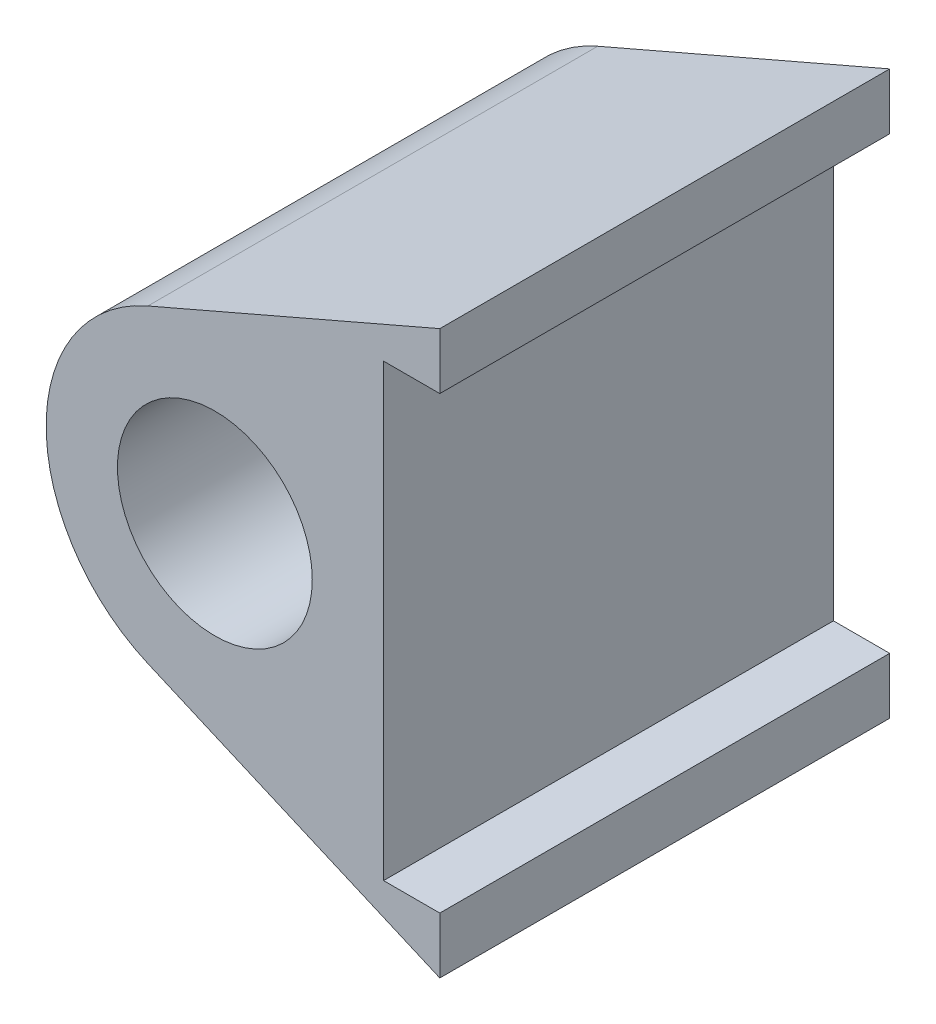
ISO-10303-21;
HEADER;
FILE_DESCRIPTION(('STEP AP214'),'2;1');
FILE_NAME('part.step','',(''),(''),'','','');
FILE_SCHEMA(('AUTOMOTIVE_DESIGN { 1 0 10303 214 1 1 1 1 }'));
ENDSEC;
DATA;
#1=APPLICATION_CONTEXT('core data for automotive mechanical design processes');
#2=APPLICATION_PROTOCOL_DEFINITION('international standard','automotive_design',2000,#1);
#3=PRODUCT_CONTEXT('',#1,'mechanical');
#4=PRODUCT('Part','Part','',(#3));
#5=PRODUCT_RELATED_PRODUCT_CATEGORY('part','',(#4));
#6=PRODUCT_DEFINITION_FORMATION('','',#4);
#7=PRODUCT_DEFINITION_CONTEXT('part definition',#1,'design');
#8=PRODUCT_DEFINITION('design','',#6,#7);
#9=PRODUCT_DEFINITION_SHAPE('','',#8);
#10=(LENGTH_UNIT() NAMED_UNIT(*) SI_UNIT(.MILLI.,.METRE.));
#11=(NAMED_UNIT(*) PLANE_ANGLE_UNIT() SI_UNIT($,.RADIAN.));
#12=(NAMED_UNIT(*) SI_UNIT($,.STERADIAN.) SOLID_ANGLE_UNIT());
#13=UNCERTAINTY_MEASURE_WITH_UNIT(LENGTH_MEASURE(1.E-05),#10,'distance_accuracy_value','');
#14=(GEOMETRIC_REPRESENTATION_CONTEXT(3) GLOBAL_UNCERTAINTY_ASSIGNED_CONTEXT((#13)) GLOBAL_UNIT_ASSIGNED_CONTEXT((#10,
#11,#12)) REPRESENTATION_CONTEXT('',''));
#15=CARTESIAN_POINT('',(0.,0.,0.));
#16=DIRECTION('',(0.,0.,1.));
#17=DIRECTION('',(1.,0.,0.));
#18=AXIS2_PLACEMENT_3D('',#15,#16,#17);
#19=CARTESIAN_POINT('',(0.,0.,50.8));
#20=DIRECTION('',(0.,0.,1.));
#21=DIRECTION('',(1.,0.,0.));
#22=AXIS2_PLACEMENT_3D('',#19,#20,#21);
#23=PLANE('',#22);
#24=DIRECTION('',(-0.917741877999257,-0.397177347499071,0.));
#25=VECTOR('',#24,1.);
#26=CARTESIAN_POINT('',(25.4,31.75,50.8));
#27=LINE('',#26,#25);
#28=CARTESIAN_POINT('',(25.4,31.75,50.8));
#29=VERTEX_POINT('',#28);
#30=CARTESIAN_POINT('',(-7.5662284698573,17.4829827758858,50.8));
#31=VERTEX_POINT('',#30);
#32=EDGE_CURVE('E164',#29,#31,#27,.T.);
#33=ORIENTED_EDGE('',*,*,#32,.T.);
#34=CARTESIAN_POINT('',(0.,0.,50.8));
#35=DIRECTION('',(0.,0.,1.));
#36=DIRECTION('',(1.,0.,0.));
#37=AXIS2_PLACEMENT_3D('',#34,#35,#36);
#38=CIRCLE('',#37,19.05);
#39=CARTESIAN_POINT('',(-7.5662284698573,-17.4829827758858,50.8));
#40=VERTEX_POINT('',#39);
#41=EDGE_CURVE('E100',#31,#40,#38,.T.);
#42=ORIENTED_EDGE('',*,*,#41,.T.);
#43=DIRECTION('',(0.917741877999256,-0.397177347499071,0.));
#44=VECTOR('',#43,1.);
#45=CARTESIAN_POINT('',(25.4,-31.75,50.8));
#46=LINE('',#45,#44);
#47=CARTESIAN_POINT('',(25.4,-31.75,50.8));
#48=VERTEX_POINT('',#47);
#49=EDGE_CURVE('E185',#40,#48,#46,.T.);
#50=ORIENTED_EDGE('',*,*,#49,.T.);
#51=DIRECTION('',(0.,1.,0.));
#52=VECTOR('',#51,1.);
#53=CARTESIAN_POINT('',(25.4,-25.4,50.8));
#54=LINE('',#53,#52);
#55=CARTESIAN_POINT('',(25.4,-25.4,50.8));
#56=VERTEX_POINT('',#55);
#57=EDGE_CURVE('E199',#48,#56,#54,.T.);
#58=ORIENTED_EDGE('',*,*,#57,.T.);
#59=DIRECTION('',(-1.,0.,0.));
#60=VECTOR('',#59,1.);
#61=CARTESIAN_POINT('',(19.05,-25.4,50.8));
#62=LINE('',#61,#60);
#63=CARTESIAN_POINT('',(19.05,-25.4,50.8));
#64=VERTEX_POINT('',#63);
#65=EDGE_CURVE('E119',#56,#64,#62,.T.);
#66=ORIENTED_EDGE('',*,*,#65,.T.);
#67=DIRECTION('',(0.,1.,0.));
#68=VECTOR('',#67,1.);
#69=CARTESIAN_POINT('',(19.05,-25.4,50.8));
#70=LINE('',#69,#68);
#71=CARTESIAN_POINT('',(19.05,25.4,50.8));
#72=VERTEX_POINT('',#71);
#73=EDGE_CURVE('E113',#64,#72,#70,.T.);
#74=ORIENTED_EDGE('',*,*,#73,.T.);
#75=DIRECTION('',(1.,0.,0.));
#76=VECTOR('',#75,1.);
#77=CARTESIAN_POINT('',(19.05,25.4,50.8));
#78=LINE('',#77,#76);
#79=CARTESIAN_POINT('',(25.4,25.4,50.8));
#80=VERTEX_POINT('',#79);
#81=EDGE_CURVE('E117',#72,#80,#78,.T.);
#82=ORIENTED_EDGE('',*,*,#81,.T.);
#83=DIRECTION('',(0.,1.,0.));
#84=VECTOR('',#83,1.);
#85=CARTESIAN_POINT('',(25.4,25.4,50.8));
#86=LINE('',#85,#84);
#87=EDGE_CURVE('E57',#80,#29,#86,.T.);
#88=ORIENTED_EDGE('',*,*,#87,.T.);
#89=EDGE_LOOP('',(#33,#42,#50,#58,#66,#74,#82,#88));
#90=FACE_BOUND('',#89,.T.);
#91=CARTESIAN_POINT('',(0.,0.,50.8));
#92=DIRECTION('',(0.,0.,1.));
#93=DIRECTION('',(1.,0.,0.));
#94=AXIS2_PLACEMENT_3D('',#91,#92,#93);
#95=CIRCLE('',#94,10.99947);
#96=CARTESIAN_POINT('',(10.99947,0.,50.8));
#97=VERTEX_POINT('',#96);
#98=EDGE_CURVE('E146',#97,#97,#95,.T.);
#99=ORIENTED_EDGE('',*,*,#98,.F.);
#100=EDGE_LOOP('',(#99));
#101=FACE_BOUND('',#100,.T.);
#102=ADVANCED_FACE('F39',(#90,#101),#23,.T.);
#103=CARTESIAN_POINT('',(0.,0.,0.));
#104=DIRECTION('',(0.,0.,1.));
#105=DIRECTION('',(1.,0.,0.));
#106=AXIS2_PLACEMENT_3D('',#103,#104,#105);
#107=PLANE('',#106);
#108=DIRECTION('',(-0.917741877999257,-0.397177347499071,0.));
#109=VECTOR('',#108,1.);
#110=CARTESIAN_POINT('',(25.4,31.75,0.));
#111=LINE('',#110,#109);
#112=CARTESIAN_POINT('',(25.4,31.75,0.));
#113=VERTEX_POINT('',#112);
#114=CARTESIAN_POINT('',(-7.5662284698573,17.4829827758858,0.));
#115=VERTEX_POINT('',#114);
#116=EDGE_CURVE('E141',#113,#115,#111,.T.);
#117=ORIENTED_EDGE('',*,*,#116,.F.);
#118=DIRECTION('',(0.,1.,0.));
#119=VECTOR('',#118,1.);
#120=CARTESIAN_POINT('',(25.4,25.4,0.));
#121=LINE('',#120,#119);
#122=CARTESIAN_POINT('',(25.4,25.4,0.));
#123=VERTEX_POINT('',#122);
#124=EDGE_CURVE('E92',#123,#113,#121,.T.);
#125=ORIENTED_EDGE('',*,*,#124,.F.);
#126=DIRECTION('',(1.,0.,0.));
#127=VECTOR('',#126,1.);
#128=CARTESIAN_POINT('',(19.05,25.4,0.));
#129=LINE('',#128,#127);
#130=CARTESIAN_POINT('',(19.05,25.4,0.));
#131=VERTEX_POINT('',#130);
#132=EDGE_CURVE('E86',#131,#123,#129,.T.);
#133=ORIENTED_EDGE('',*,*,#132,.F.);
#134=DIRECTION('',(0.,1.,0.));
#135=VECTOR('',#134,1.);
#136=CARTESIAN_POINT('',(19.05,-25.4,0.));
#137=LINE('',#136,#135);
#138=CARTESIAN_POINT('',(19.05,-25.4,0.));
#139=VERTEX_POINT('',#138);
#140=EDGE_CURVE('E128',#139,#131,#137,.T.);
#141=ORIENTED_EDGE('',*,*,#140,.F.);
#142=DIRECTION('',(-1.,0.,0.));
#143=VECTOR('',#142,1.);
#144=CARTESIAN_POINT('',(19.05,-25.4,0.));
#145=LINE('',#144,#143);
#146=CARTESIAN_POINT('',(25.4,-25.4,0.));
#147=VERTEX_POINT('',#146);
#148=EDGE_CURVE('E155',#147,#139,#145,.T.);
#149=ORIENTED_EDGE('',*,*,#148,.F.);
#150=DIRECTION('',(0.,1.,0.));
#151=VECTOR('',#150,1.);
#152=CARTESIAN_POINT('',(25.4,-25.4,0.));
#153=LINE('',#152,#151);
#154=CARTESIAN_POINT('',(25.4,-31.75,0.));
#155=VERTEX_POINT('',#154);
#156=EDGE_CURVE('E152',#155,#147,#153,.T.);
#157=ORIENTED_EDGE('',*,*,#156,.F.);
#158=DIRECTION('',(0.917741877999256,-0.397177347499071,0.));
#159=VECTOR('',#158,1.);
#160=CARTESIAN_POINT('',(25.4,-31.75,0.));
#161=LINE('',#160,#159);
#162=CARTESIAN_POINT('',(-7.5662284698573,-17.4829827758858,0.));
#163=VERTEX_POINT('',#162);
#164=EDGE_CURVE('E149',#163,#155,#161,.T.);
#165=ORIENTED_EDGE('',*,*,#164,.F.);
#166=CARTESIAN_POINT('',(0.,0.,0.));
#167=DIRECTION('',(0.,0.,1.));
#168=DIRECTION('',(1.,0.,0.));
#169=AXIS2_PLACEMENT_3D('',#166,#167,#168);
#170=CIRCLE('',#169,19.05);
#171=EDGE_CURVE('E145',#115,#163,#170,.T.);
#172=ORIENTED_EDGE('',*,*,#171,.F.);
#173=EDGE_LOOP('',(#117,#125,#133,#141,#149,#157,#165,#172));
#174=FACE_BOUND('',#173,.T.);
#175=CARTESIAN_POINT('',(0.,0.,0.));
#176=DIRECTION('',(0.,0.,1.));
#177=DIRECTION('',(1.,0.,0.));
#178=AXIS2_PLACEMENT_3D('',#175,#176,#177);
#179=CIRCLE('',#178,10.99947);
#180=CARTESIAN_POINT('',(10.99947,0.,0.));
#181=VERTEX_POINT('',#180);
#182=EDGE_CURVE('E209',#181,#181,#179,.T.);
#183=ORIENTED_EDGE('',*,*,#182,.T.);
#184=EDGE_LOOP('',(#183));
#185=FACE_BOUND('',#184,.T.);
#186=ADVANCED_FACE('F189',(#174,#185),#107,.F.);
#187=CARTESIAN_POINT('',(25.4,31.75,50.8));
#188=DIRECTION('',(0.397177347499071,-0.917741877999257,0.));
#189=DIRECTION('',(0.917741877999257,0.397177347499071,0.));
#190=AXIS2_PLACEMENT_3D('',#187,#188,#189);
#191=PLANE('',#190);
#192=ORIENTED_EDGE('',*,*,#116,.T.);
#193=DIRECTION('',(0.,0.,-1.));
#194=VECTOR('',#193,1.);
#195=CARTESIAN_POINT('',(-7.5662284698573,17.4829827758858,50.8));
#196=LINE('',#195,#194);
#197=EDGE_CURVE('E11',#31,#115,#196,.T.);
#198=ORIENTED_EDGE('',*,*,#197,.F.);
#199=ORIENTED_EDGE('',*,*,#32,.F.);
#200=DIRECTION('',(0.,0.,-1.));
#201=VECTOR('',#200,1.);
#202=CARTESIAN_POINT('',(25.4,31.75,50.8));
#203=LINE('',#202,#201);
#204=EDGE_CURVE('E137',#29,#113,#203,.T.);
#205=ORIENTED_EDGE('',*,*,#204,.T.);
#206=EDGE_LOOP('',(#192,#198,#199,#205));
#207=FACE_BOUND('',#206,.T.);
#208=ADVANCED_FACE('F41',(#207),#191,.F.);
#209=CARTESIAN_POINT('',(0.,0.,50.8));
#210=DIRECTION('',(0.,0.,-1.));
#211=DIRECTION('',(-1.,0.,0.));
#212=AXIS2_PLACEMENT_3D('',#209,#210,#211);
#213=CYLINDRICAL_SURFACE('',#212,19.05);
#214=ORIENTED_EDGE('',*,*,#171,.T.);
#215=DIRECTION('',(0.,0.,-1.));
#216=VECTOR('',#215,1.);
#217=CARTESIAN_POINT('',(-7.5662284698573,-17.4829827758858,50.8));
#218=LINE('',#217,#216);
#219=EDGE_CURVE('E49',#40,#163,#218,.T.);
#220=ORIENTED_EDGE('',*,*,#219,.F.);
#221=ORIENTED_EDGE('',*,*,#41,.F.);
#222=ORIENTED_EDGE('',*,*,#197,.T.);
#223=EDGE_LOOP('',(#214,#220,#221,#222));
#224=FACE_BOUND('',#223,.T.);
#225=ADVANCED_FACE('F239',(#224),#213,.T.);
#226=CARTESIAN_POINT('',(25.4,-31.75,50.8));
#227=DIRECTION('',(0.397177347499071,0.917741877999257,0.));
#228=DIRECTION('',(-0.917741877999257,0.397177347499071,0.));
#229=AXIS2_PLACEMENT_3D('',#226,#227,#228);
#230=PLANE('',#229);
#231=ORIENTED_EDGE('',*,*,#164,.T.);
#232=DIRECTION('',(0.,0.,-1.));
#233=VECTOR('',#232,1.);
#234=CARTESIAN_POINT('',(25.4,-31.75,50.8));
#235=LINE('',#234,#233);
#236=EDGE_CURVE('E175',#48,#155,#235,.T.);
#237=ORIENTED_EDGE('',*,*,#236,.F.);
#238=ORIENTED_EDGE('',*,*,#49,.F.);
#239=ORIENTED_EDGE('',*,*,#219,.T.);
#240=EDGE_LOOP('',(#231,#237,#238,#239));
#241=FACE_BOUND('',#240,.T.);
#242=ADVANCED_FACE('F183',(#241),#230,.F.);
#243=CARTESIAN_POINT('',(25.4,-25.4,50.8));
#244=DIRECTION('',(-1.,0.,0.));
#245=DIRECTION('',(0.,-1.,0.));
#246=AXIS2_PLACEMENT_3D('',#243,#244,#245);
#247=PLANE('',#246);
#248=ORIENTED_EDGE('',*,*,#156,.T.);
#249=DIRECTION('',(0.,0.,-1.));
#250=VECTOR('',#249,1.);
#251=CARTESIAN_POINT('',(25.4,-25.4,50.8));
#252=LINE('',#251,#250);
#253=EDGE_CURVE('E171',#56,#147,#252,.T.);
#254=ORIENTED_EDGE('',*,*,#253,.F.);
#255=ORIENTED_EDGE('',*,*,#57,.F.);
#256=ORIENTED_EDGE('',*,*,#236,.T.);
#257=EDGE_LOOP('',(#248,#254,#255,#256));
#258=FACE_BOUND('',#257,.T.);
#259=ADVANCED_FACE('F194',(#258),#247,.F.);
#260=CARTESIAN_POINT('',(19.05,-25.4,50.8));
#261=DIRECTION('',(0.,-1.,0.));
#262=DIRECTION('',(0.,0.,-1.));
#263=AXIS2_PLACEMENT_3D('',#260,#261,#262);
#264=PLANE('',#263);
#265=ORIENTED_EDGE('',*,*,#148,.T.);
#266=DIRECTION('',(0.,0.,-1.));
#267=VECTOR('',#266,1.);
#268=CARTESIAN_POINT('',(19.05,-25.4,50.8));
#269=LINE('',#268,#267);
#270=EDGE_CURVE('E130',#64,#139,#269,.T.);
#271=ORIENTED_EDGE('',*,*,#270,.F.);
#272=ORIENTED_EDGE('',*,*,#65,.F.);
#273=ORIENTED_EDGE('',*,*,#253,.T.);
#274=EDGE_LOOP('',(#265,#271,#272,#273));
#275=FACE_BOUND('',#274,.T.);
#276=ADVANCED_FACE('F197',(#275),#264,.F.);
#277=CARTESIAN_POINT('',(19.05,-25.4,50.8));
#278=DIRECTION('',(-1.,0.,0.));
#279=DIRECTION('',(0.,-1.,0.));
#280=AXIS2_PLACEMENT_3D('',#277,#278,#279);
#281=PLANE('',#280);
#282=ORIENTED_EDGE('',*,*,#140,.T.);
#283=DIRECTION('',(0.,0.,-1.));
#284=VECTOR('',#283,1.);
#285=CARTESIAN_POINT('',(19.05,25.4,50.8));
#286=LINE('',#285,#284);
#287=EDGE_CURVE('E125',#72,#131,#286,.T.);
#288=ORIENTED_EDGE('',*,*,#287,.F.);
#289=ORIENTED_EDGE('',*,*,#73,.F.);
#290=ORIENTED_EDGE('',*,*,#270,.T.);
#291=EDGE_LOOP('',(#282,#288,#289,#290));
#292=FACE_BOUND('',#291,.T.);
#293=ADVANCED_FACE('F126',(#292),#281,.F.);
#294=CARTESIAN_POINT('',(19.05,25.4,50.8));
#295=DIRECTION('',(0.,1.,0.));
#296=DIRECTION('',(0.,0.,1.));
#297=AXIS2_PLACEMENT_3D('',#294,#295,#296);
#298=PLANE('',#297);
#299=ORIENTED_EDGE('',*,*,#132,.T.);
#300=DIRECTION('',(0.,0.,-1.));
#301=VECTOR('',#300,1.);
#302=CARTESIAN_POINT('',(25.4,25.4,50.8));
#303=LINE('',#302,#301);
#304=EDGE_CURVE('E131',#80,#123,#303,.T.);
#305=ORIENTED_EDGE('',*,*,#304,.F.);
#306=ORIENTED_EDGE('',*,*,#81,.F.);
#307=ORIENTED_EDGE('',*,*,#287,.T.);
#308=EDGE_LOOP('',(#299,#305,#306,#307));
#309=FACE_BOUND('',#308,.T.);
#310=ADVANCED_FACE('F133',(#309),#298,.F.);
#311=CARTESIAN_POINT('',(25.4,25.4,50.8));
#312=DIRECTION('',(-1.,0.,0.));
#313=DIRECTION('',(0.,-1.,0.));
#314=AXIS2_PLACEMENT_3D('',#311,#312,#313);
#315=PLANE('',#314);
#316=ORIENTED_EDGE('',*,*,#124,.T.);
#317=ORIENTED_EDGE('',*,*,#204,.F.);
#318=ORIENTED_EDGE('',*,*,#87,.F.);
#319=ORIENTED_EDGE('',*,*,#304,.T.);
#320=EDGE_LOOP('',(#316,#317,#318,#319));
#321=FACE_BOUND('',#320,.T.);
#322=ADVANCED_FACE('F227',(#321),#315,.F.);
#323=CARTESIAN_POINT('',(0.,0.,50.8));
#324=DIRECTION('',(0.,0.,-1.));
#325=DIRECTION('',(-1.,0.,0.));
#326=AXIS2_PLACEMENT_3D('',#323,#324,#325);
#327=CYLINDRICAL_SURFACE('',#326,10.99947);
#328=ORIENTED_EDGE('',*,*,#98,.T.);
#329=EDGE_LOOP('',(#328));
#330=FACE_BOUND('',#329,.T.);
#331=ORIENTED_EDGE('',*,*,#182,.F.);
#332=EDGE_LOOP('',(#331));
#333=FACE_BOUND('',#332,.T.);
#334=ADVANCED_FACE('F217',(#330,#333),#327,.F.);
#335=CLOSED_SHELL('',(#102,#186,#208,#225,#242,#259,#276,#293,#310,#322,#334));
#336=MANIFOLD_SOLID_BREP('B2',#335);
#337=ADVANCED_BREP_SHAPE_REPRESENTATION('',(#18,#336),#14);
#338=SHAPE_DEFINITION_REPRESENTATION(#9,#337);
ENDSEC;
END-ISO-10303-21;
